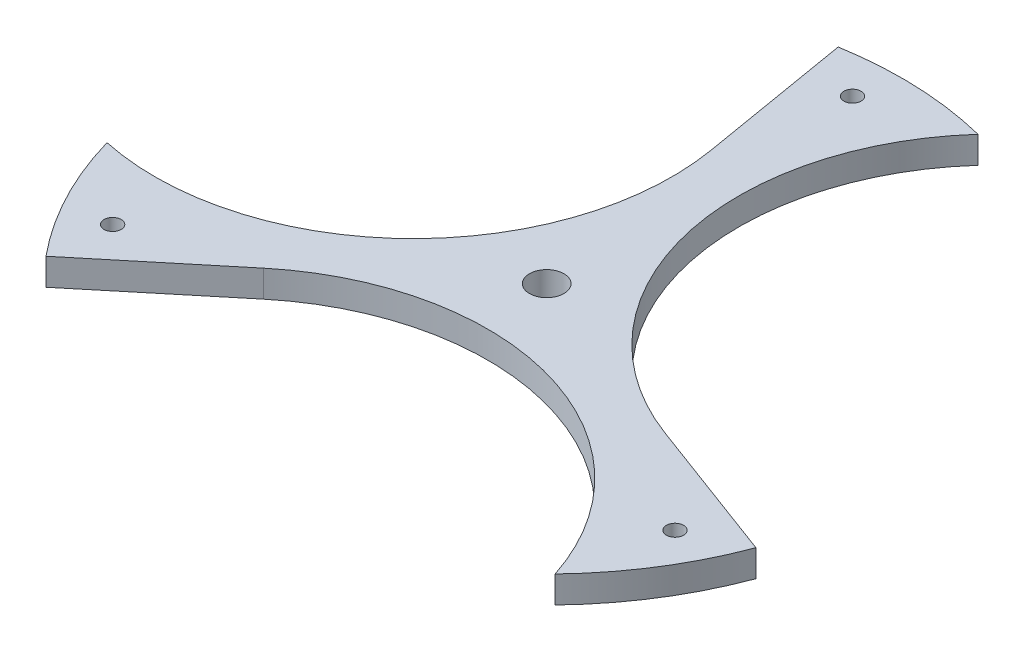
ISO-10303-21;
HEADER;
FILE_DESCRIPTION(('STEP AP214'),'2;1');
FILE_NAME('part.step','',(''),(''),'','','');
FILE_SCHEMA(('AUTOMOTIVE_DESIGN { 1 0 10303 214 1 1 1 1 }'));
ENDSEC;
DATA;
#1=APPLICATION_CONTEXT('core data for automotive mechanical design processes');
#2=APPLICATION_PROTOCOL_DEFINITION('international standard','automotive_design',2000,#1);
#3=PRODUCT_CONTEXT('',#1,'mechanical');
#4=PRODUCT('Part','Part','',(#3));
#5=PRODUCT_RELATED_PRODUCT_CATEGORY('part','',(#4));
#6=PRODUCT_DEFINITION_FORMATION('','',#4);
#7=PRODUCT_DEFINITION_CONTEXT('part definition',#1,'design');
#8=PRODUCT_DEFINITION('design','',#6,#7);
#9=PRODUCT_DEFINITION_SHAPE('','',#8);
#10=(LENGTH_UNIT() NAMED_UNIT(*) SI_UNIT(.MILLI.,.METRE.));
#11=(NAMED_UNIT(*) PLANE_ANGLE_UNIT() SI_UNIT($,.RADIAN.));
#12=(NAMED_UNIT(*) SI_UNIT($,.STERADIAN.) SOLID_ANGLE_UNIT());
#13=UNCERTAINTY_MEASURE_WITH_UNIT(LENGTH_MEASURE(1.E-05),#10,'distance_accuracy_value','');
#14=(GEOMETRIC_REPRESENTATION_CONTEXT(3) GLOBAL_UNCERTAINTY_ASSIGNED_CONTEXT((#13)) GLOBAL_UNIT_ASSIGNED_CONTEXT((#10,
#11,#12)) REPRESENTATION_CONTEXT('',''));
#15=CARTESIAN_POINT('',(0.,0.,0.));
#16=DIRECTION('',(0.,0.,1.));
#17=DIRECTION('',(1.,0.,0.));
#18=AXIS2_PLACEMENT_3D('',#15,#16,#17);
#19=CARTESIAN_POINT('',(1.81029657284749,2.4765,60.2978312322951));
#20=DIRECTION('',(0.,1.,0.));
#21=DIRECTION('',(0.,0.,1.));
#22=AXIS2_PLACEMENT_3D('',#19,#20,#21);
#23=PLANE('',#22);
#24=CARTESIAN_POINT('',(-49.4210911134615,2.4765,30.5465083084248));
#25=DIRECTION('',(0.,1.,0.));
#26=DIRECTION('',(0.,0.,1.));
#27=AXIS2_PLACEMENT_3D('',#24,#25,#26);
#28=CIRCLE('',#27,1.5875);
#29=CARTESIAN_POINT('',(-49.4210911134615,2.4765,32.1340083084248));
#30=VERTEX_POINT('',#29);
#31=EDGE_CURVE('E214',#30,#30,#28,.T.);
#32=ORIENTED_EDGE('',*,*,#31,.F.);
#33=EDGE_LOOP('',(#32));
#34=FACE_BOUND('',#33,.T.);
#35=CARTESIAN_POINT('',(0.,2.4765,0.));
#36=DIRECTION('',(0.,1.,0.));
#37=DIRECTION('',(0.,0.,1.));
#38=AXIS2_PLACEMENT_3D('',#35,#36,#37);
#39=CIRCLE('',#38,3.175);
#40=CARTESIAN_POINT('',(0.,2.4765,3.17500000000003));
#41=VERTEX_POINT('',#40);
#42=EDGE_CURVE('E150',#41,#41,#39,.T.);
#43=ORIENTED_EDGE('',*,*,#42,.F.);
#44=EDGE_LOOP('',(#43));
#45=FACE_BOUND('',#44,.T.);
#46=CARTESIAN_POINT('',(1.81029657284749,2.4765,60.2978312322951));
#47=DIRECTION('',(0.,-1.,0.));
#48=DIRECTION('',(0.,0.,1.));
#49=AXIS2_PLACEMENT_3D('',#46,#47,#48);
#50=CIRCLE('',#49,47.625);
#51=CARTESIAN_POINT('',(-28.5363220622247,2.4765,23.5932897909763));
#52=VERTEX_POINT('',#51);
#53=CARTESIAN_POINT('',(47.093148028681,2.4765,45.546424891579));
#54=VERTEX_POINT('',#53);
#55=EDGE_CURVE('E163',#52,#54,#50,.T.);
#56=ORIENTED_EDGE('',*,*,#55,.T.);
#57=CARTESIAN_POINT('',(0.,2.4765,0.));
#58=DIRECTION('',(0.,1.,0.));
#59=DIRECTION('',(0.,0.,1.));
#60=AXIS2_PLACEMENT_3D('',#57,#58,#59);
#61=CIRCLE('',#60,65.5151998520611);
#62=CARTESIAN_POINT('',(61.3995568393179,2.4765,22.8546676105973));
#63=VERTEX_POINT('',#62);
#64=EDGE_CURVE('E106',#54,#63,#61,.T.);
#65=ORIENTED_EDGE('',*,*,#64,.T.);
#66=DIRECTION('',(-0.937180333387722,0.,-0.348845270444188));
#67=VECTOR('',#66,1.);
#68=CARTESIAN_POINT('',(34.7005493489459,2.4765,12.9165349409727));
#69=LINE('',#68,#67);
#70=CARTESIAN_POINT('',(34.7005493489459,2.4765,12.9165349409727));
#71=VERTEX_POINT('',#70);
#72=EDGE_CURVE('E181',#63,#71,#69,.T.);
#73=ORIENTED_EDGE('',*,*,#72,.T.);
#74=CARTESIAN_POINT('',(51.3143053538503,2.4765,-31.7166784366176));
#75=DIRECTION('',(0.,-1.,0.));
#76=DIRECTION('',(0.,0.,1.));
#77=AXIS2_PLACEMENT_3D('',#74,#75,#76);
#78=CIRCLE('',#77,47.625);
#79=CARTESIAN_POINT('',(15.8977869933265,2.4765,-63.5570749828084));
#80=VERTEX_POINT('',#79);
#81=EDGE_CURVE('E198',#71,#80,#78,.T.);
#82=ORIENTED_EDGE('',*,*,#81,.T.);
#83=CARTESIAN_POINT('',(0.,2.4765,0.));
#84=DIRECTION('',(0.,1.,0.));
#85=DIRECTION('',(0.,0.,1.));
#86=AXIS2_PLACEMENT_3D('',#83,#84,#85);
#87=CIRCLE('',#86,65.5151998520611);
#88=CARTESIAN_POINT('',(-10.9070556738326,2.4765,-64.6009098092544));
#89=VERTEX_POINT('',#88);
#90=EDGE_CURVE('E197',#80,#89,#87,.T.);
#91=ORIENTED_EDGE('',*,*,#90,.T.);
#92=DIRECTION('',(0.166481300499146,0.,0.98604461186303));
#93=VECTOR('',#92,1.);
#94=CARTESIAN_POINT('',(-6.16422728672149,2.4765,-36.509824731949));
#95=LINE('',#94,#93);
#96=CARTESIAN_POINT('',(-6.16422728672147,2.4765,-36.509824731949));
#97=VERTEX_POINT('',#96);
#98=EDGE_CURVE('E128',#89,#97,#95,.T.);
#99=ORIENTED_EDGE('',*,*,#98,.T.);
#100=CARTESIAN_POINT('',(-53.1246019266983,2.4765,-28.5811527956771));
#101=DIRECTION('',(0.,-1.,0.));
#102=DIRECTION('',(0.,0.,1.));
#103=AXIS2_PLACEMENT_3D('',#100,#101,#102);
#104=CIRCLE('',#103,47.625);
#105=CARTESIAN_POINT('',(-62.9909350220076,2.4765,18.01065009123));
#106=VERTEX_POINT('',#105);
#107=EDGE_CURVE('E122',#97,#106,#104,.T.);
#108=ORIENTED_EDGE('',*,*,#107,.T.);
#109=CARTESIAN_POINT('',(0.,2.4765,0.));
#110=DIRECTION('',(0.,1.,0.));
#111=DIRECTION('',(0.,0.,1.));
#112=AXIS2_PLACEMENT_3D('',#109,#110,#111);
#113=CIRCLE('',#112,65.5151998520611);
#114=CARTESIAN_POINT('',(-50.4925011654858,2.4765,41.746242198657));
#115=VERTEX_POINT('',#114);
#116=EDGE_CURVE('E126',#106,#115,#113,.T.);
#117=ORIENTED_EDGE('',*,*,#116,.T.);
#118=DIRECTION('',(0.770699032888583,0.,-0.637199341418839));
#119=VECTOR('',#118,1.);
#120=CARTESIAN_POINT('',(-28.5363220622247,2.4765,23.5932897909763));
#121=LINE('',#120,#119);
#122=EDGE_CURVE('E60',#115,#52,#121,.T.);
#123=ORIENTED_EDGE('',*,*,#122,.T.);
#124=EDGE_LOOP('',(#56,#65,#73,#82,#91,#99,#108,#117,#123));
#125=FACE_BOUND('',#124,.T.);
#126=CARTESIAN_POINT('',(-1.74350663527732,2.4765,-58.0731745412153));
#127=DIRECTION('',(0.,1.,0.));
#128=DIRECTION('',(0.,0.,1.));
#129=AXIS2_PLACEMENT_3D('',#126,#127,#128);
#130=CIRCLE('',#129,1.5875);
#131=CARTESIAN_POINT('',(-1.74350663527732,2.4765,-56.4856745412153));
#132=VERTEX_POINT('',#131);
#133=EDGE_CURVE('E208',#132,#132,#130,.T.);
#134=ORIENTED_EDGE('',*,*,#133,.F.);
#135=EDGE_LOOP('',(#134));
#136=FACE_BOUND('',#135,.T.);
#137=CARTESIAN_POINT('',(51.1645977487387,2.4765,27.5266662327911));
#138=DIRECTION('',(0.,1.,0.));
#139=DIRECTION('',(0.,0.,1.));
#140=AXIS2_PLACEMENT_3D('',#137,#138,#139);
#141=CIRCLE('',#140,1.5875);
#142=CARTESIAN_POINT('',(51.1645977487387,2.4765,29.1141662327911));
#143=VERTEX_POINT('',#142);
#144=EDGE_CURVE('E220',#143,#143,#141,.T.);
#145=ORIENTED_EDGE('',*,*,#144,.F.);
#146=EDGE_LOOP('',(#145));
#147=FACE_BOUND('',#146,.T.);
#148=ADVANCED_FACE('F43',(#34,#45,#125,#136,#147),#23,.T.);
#149=CARTESIAN_POINT('',(1.81029657284749,-2.4765,60.2978312322951));
#150=DIRECTION('',(0.,1.,0.));
#151=DIRECTION('',(0.,0.,1.));
#152=AXIS2_PLACEMENT_3D('',#149,#150,#151);
#153=PLANE('',#152);
#154=CARTESIAN_POINT('',(1.81029657284749,-2.4765,60.2978312322951));
#155=DIRECTION('',(0.,-1.,0.));
#156=DIRECTION('',(0.,0.,1.));
#157=AXIS2_PLACEMENT_3D('',#154,#155,#156);
#158=CIRCLE('',#157,47.625);
#159=CARTESIAN_POINT('',(-28.5363220622247,-2.4765,23.5932897909763));
#160=VERTEX_POINT('',#159);
#161=CARTESIAN_POINT('',(47.093148028681,-2.4765,45.546424891579));
#162=VERTEX_POINT('',#161);
#163=EDGE_CURVE('E146',#160,#162,#158,.T.);
#164=ORIENTED_EDGE('',*,*,#163,.F.);
#165=DIRECTION('',(0.770699032888583,0.,-0.637199341418839));
#166=VECTOR('',#165,1.);
#167=CARTESIAN_POINT('',(-28.5363220622247,-2.4765,23.5932897909763));
#168=LINE('',#167,#166);
#169=CARTESIAN_POINT('',(-50.4925011654858,-2.4765,41.746242198657));
#170=VERTEX_POINT('',#169);
#171=EDGE_CURVE('E98',#170,#160,#168,.T.);
#172=ORIENTED_EDGE('',*,*,#171,.F.);
#173=CARTESIAN_POINT('',(0.,-2.4765,0.));
#174=DIRECTION('',(0.,1.,0.));
#175=DIRECTION('',(0.,0.,1.));
#176=AXIS2_PLACEMENT_3D('',#173,#174,#175);
#177=CIRCLE('',#176,65.5151998520611);
#178=CARTESIAN_POINT('',(-62.9909350220076,-2.4765,18.01065009123));
#179=VERTEX_POINT('',#178);
#180=EDGE_CURVE('E92',#179,#170,#177,.T.);
#181=ORIENTED_EDGE('',*,*,#180,.F.);
#182=CARTESIAN_POINT('',(-53.1246019266983,-2.4765,-28.5811527956771));
#183=DIRECTION('',(0.,-1.,0.));
#184=DIRECTION('',(0.,0.,1.));
#185=AXIS2_PLACEMENT_3D('',#182,#183,#184);
#186=CIRCLE('',#185,47.625);
#187=CARTESIAN_POINT('',(-6.16422728672147,-2.4765,-36.509824731949));
#188=VERTEX_POINT('',#187);
#189=EDGE_CURVE('E136',#188,#179,#186,.T.);
#190=ORIENTED_EDGE('',*,*,#189,.F.);
#191=DIRECTION('',(0.166481300499146,0.,0.98604461186303));
#192=VECTOR('',#191,1.);
#193=CARTESIAN_POINT('',(-6.16422728672149,-2.4765,-36.509824731949));
#194=LINE('',#193,#192);
#195=CARTESIAN_POINT('',(-10.9070556738326,-2.4765,-64.6009098092544));
#196=VERTEX_POINT('',#195);
#197=EDGE_CURVE('E158',#196,#188,#194,.T.);
#198=ORIENTED_EDGE('',*,*,#197,.F.);
#199=CARTESIAN_POINT('',(0.,-2.4765,0.));
#200=DIRECTION('',(0.,1.,0.));
#201=DIRECTION('',(0.,0.,1.));
#202=AXIS2_PLACEMENT_3D('',#199,#200,#201);
#203=CIRCLE('',#202,65.5151998520611);
#204=CARTESIAN_POINT('',(15.8977869933265,-2.4765,-63.5570749828084));
#205=VERTEX_POINT('',#204);
#206=EDGE_CURVE('E156',#205,#196,#203,.T.);
#207=ORIENTED_EDGE('',*,*,#206,.F.);
#208=CARTESIAN_POINT('',(51.3143053538503,-2.4765,-31.7166784366176));
#209=DIRECTION('',(0.,-1.,0.));
#210=DIRECTION('',(0.,0.,1.));
#211=AXIS2_PLACEMENT_3D('',#208,#209,#210);
#212=CIRCLE('',#211,47.625);
#213=CARTESIAN_POINT('',(34.7005493489459,-2.4765,12.9165349409727));
#214=VERTEX_POINT('',#213);
#215=EDGE_CURVE('E154',#214,#205,#212,.T.);
#216=ORIENTED_EDGE('',*,*,#215,.F.);
#217=DIRECTION('',(-0.937180333387722,0.,-0.348845270444188));
#218=VECTOR('',#217,1.);
#219=CARTESIAN_POINT('',(34.7005493489459,-2.4765,12.9165349409727));
#220=LINE('',#219,#218);
#221=CARTESIAN_POINT('',(61.3995568393179,-2.4765,22.8546676105973));
#222=VERTEX_POINT('',#221);
#223=EDGE_CURVE('E152',#222,#214,#220,.T.);
#224=ORIENTED_EDGE('',*,*,#223,.F.);
#225=CARTESIAN_POINT('',(0.,-2.4765,0.));
#226=DIRECTION('',(0.,1.,0.));
#227=DIRECTION('',(0.,0.,1.));
#228=AXIS2_PLACEMENT_3D('',#225,#226,#227);
#229=CIRCLE('',#228,65.5151998520611);
#230=EDGE_CURVE('E149',#162,#222,#229,.T.);
#231=ORIENTED_EDGE('',*,*,#230,.F.);
#232=EDGE_LOOP('',(#164,#172,#181,#190,#198,#207,#216,#224,#231));
#233=FACE_BOUND('',#232,.T.);
#234=CARTESIAN_POINT('',(0.,-2.4765,0.));
#235=DIRECTION('',(0.,1.,0.));
#236=DIRECTION('',(0.,0.,1.));
#237=AXIS2_PLACEMENT_3D('',#234,#235,#236);
#238=CIRCLE('',#237,3.175);
#239=CARTESIAN_POINT('',(0.,-2.4765,3.17500000000003));
#240=VERTEX_POINT('',#239);
#241=EDGE_CURVE('E205',#240,#240,#238,.T.);
#242=ORIENTED_EDGE('',*,*,#241,.T.);
#243=EDGE_LOOP('',(#242));
#244=FACE_BOUND('',#243,.T.);
#245=CARTESIAN_POINT('',(-1.74350663527732,-2.4765,-58.0731745412153));
#246=DIRECTION('',(0.,1.,0.));
#247=DIRECTION('',(0.,0.,1.));
#248=AXIS2_PLACEMENT_3D('',#245,#246,#247);
#249=CIRCLE('',#248,1.5875);
#250=CARTESIAN_POINT('',(-1.74350663527732,-2.4765,-56.4856745412153));
#251=VERTEX_POINT('',#250);
#252=EDGE_CURVE('E211',#251,#251,#249,.T.);
#253=ORIENTED_EDGE('',*,*,#252,.T.);
#254=EDGE_LOOP('',(#253));
#255=FACE_BOUND('',#254,.T.);
#256=CARTESIAN_POINT('',(-49.4210911134615,-2.4765,30.5465083084248));
#257=DIRECTION('',(0.,1.,0.));
#258=DIRECTION('',(0.,0.,1.));
#259=AXIS2_PLACEMENT_3D('',#256,#257,#258);
#260=CIRCLE('',#259,1.5875);
#261=CARTESIAN_POINT('',(-49.4210911134615,-2.4765,32.1340083084248));
#262=VERTEX_POINT('',#261);
#263=EDGE_CURVE('E217',#262,#262,#260,.T.);
#264=ORIENTED_EDGE('',*,*,#263,.T.);
#265=EDGE_LOOP('',(#264));
#266=FACE_BOUND('',#265,.T.);
#267=CARTESIAN_POINT('',(51.1645977487387,-2.4765,27.5266662327911));
#268=DIRECTION('',(0.,1.,0.));
#269=DIRECTION('',(0.,0.,1.));
#270=AXIS2_PLACEMENT_3D('',#267,#268,#269);
#271=CIRCLE('',#270,1.5875);
#272=CARTESIAN_POINT('',(51.1645977487387,-2.4765,29.1141662327911));
#273=VERTEX_POINT('',#272);
#274=EDGE_CURVE('E223',#273,#273,#271,.T.);
#275=ORIENTED_EDGE('',*,*,#274,.T.);
#276=EDGE_LOOP('',(#275));
#277=FACE_BOUND('',#276,.T.);
#278=ADVANCED_FACE('F185',(#233,#244,#255,#266,#277),#153,.F.);
#279=CARTESIAN_POINT('',(1.81029657284749,2.4765,60.2978312322951));
#280=DIRECTION('',(0.,-1.,0.));
#281=DIRECTION('',(0.,0.,-1.));
#282=AXIS2_PLACEMENT_3D('',#279,#280,#281);
#283=CYLINDRICAL_SURFACE('',#282,47.625);
#284=ORIENTED_EDGE('',*,*,#163,.T.);
#285=DIRECTION('',(0.,-1.,0.));
#286=VECTOR('',#285,1.);
#287=CARTESIAN_POINT('',(47.093148028681,2.4765,45.546424891579));
#288=LINE('',#287,#286);
#289=EDGE_CURVE('E13',#54,#162,#288,.T.);
#290=ORIENTED_EDGE('',*,*,#289,.F.);
#291=ORIENTED_EDGE('',*,*,#55,.F.);
#292=DIRECTION('',(0.,-1.,0.));
#293=VECTOR('',#292,1.);
#294=CARTESIAN_POINT('',(-28.5363220622247,2.4765,23.5932897909763));
#295=LINE('',#294,#293);
#296=EDGE_CURVE('E142',#52,#160,#295,.T.);
#297=ORIENTED_EDGE('',*,*,#296,.T.);
#298=EDGE_LOOP('',(#284,#290,#291,#297));
#299=FACE_BOUND('',#298,.T.);
#300=ADVANCED_FACE('F45',(#299),#283,.F.);
#301=CARTESIAN_POINT('',(0.,2.4765,0.));
#302=DIRECTION('',(0.,-1.,0.));
#303=DIRECTION('',(0.,0.,-1.));
#304=AXIS2_PLACEMENT_3D('',#301,#302,#303);
#305=CYLINDRICAL_SURFACE('',#304,65.5151998520611);
#306=ORIENTED_EDGE('',*,*,#230,.T.);
#307=DIRECTION('',(0.,-1.,0.));
#308=VECTOR('',#307,1.);
#309=CARTESIAN_POINT('',(61.3995568393179,2.4765,22.8546676105973));
#310=LINE('',#309,#308);
#311=EDGE_CURVE('E52',#63,#222,#310,.T.);
#312=ORIENTED_EDGE('',*,*,#311,.F.);
#313=ORIENTED_EDGE('',*,*,#64,.F.);
#314=ORIENTED_EDGE('',*,*,#289,.T.);
#315=EDGE_LOOP('',(#306,#312,#313,#314));
#316=FACE_BOUND('',#315,.T.);
#317=ADVANCED_FACE('F261',(#316),#305,.T.);
#318=CARTESIAN_POINT('',(34.7005493489459,2.4765,12.9165349409727));
#319=DIRECTION('',(-0.348845270444188,0.,0.937180333387722));
#320=DIRECTION('',(0.937180333387722,0.,0.348845270444188));
#321=AXIS2_PLACEMENT_3D('',#318,#319,#320);
#322=PLANE('',#321);
#323=ORIENTED_EDGE('',*,*,#223,.T.);
#324=DIRECTION('',(0.,-1.,0.));
#325=VECTOR('',#324,1.);
#326=CARTESIAN_POINT('',(34.7005493489459,2.4765,12.9165349409727));
#327=LINE('',#326,#325);
#328=EDGE_CURVE('E173',#71,#214,#327,.T.);
#329=ORIENTED_EDGE('',*,*,#328,.F.);
#330=ORIENTED_EDGE('',*,*,#72,.F.);
#331=ORIENTED_EDGE('',*,*,#311,.T.);
#332=EDGE_LOOP('',(#323,#329,#330,#331));
#333=FACE_BOUND('',#332,.T.);
#334=ADVANCED_FACE('F179',(#333),#322,.F.);
#335=CARTESIAN_POINT('',(51.3143053538503,2.4765,-31.7166784366176));
#336=DIRECTION('',(0.,-1.,0.));
#337=DIRECTION('',(0.,0.,-1.));
#338=AXIS2_PLACEMENT_3D('',#335,#336,#337);
#339=CYLINDRICAL_SURFACE('',#338,47.625);
#340=ORIENTED_EDGE('',*,*,#215,.T.);
#341=DIRECTION('',(0.,-1.,0.));
#342=VECTOR('',#341,1.);
#343=CARTESIAN_POINT('',(15.8977869933265,2.4765,-63.5570749828084));
#344=LINE('',#343,#342);
#345=EDGE_CURVE('E170',#80,#205,#344,.T.);
#346=ORIENTED_EDGE('',*,*,#345,.F.);
#347=ORIENTED_EDGE('',*,*,#81,.F.);
#348=ORIENTED_EDGE('',*,*,#328,.T.);
#349=EDGE_LOOP('',(#340,#346,#347,#348));
#350=FACE_BOUND('',#349,.T.);
#351=ADVANCED_FACE('F191',(#350),#339,.F.);
#352=CARTESIAN_POINT('',(0.,2.4765,0.));
#353=DIRECTION('',(0.,-1.,0.));
#354=DIRECTION('',(0.,0.,-1.));
#355=AXIS2_PLACEMENT_3D('',#352,#353,#354);
#356=CYLINDRICAL_SURFACE('',#355,65.5151998520611);
#357=ORIENTED_EDGE('',*,*,#206,.T.);
#358=DIRECTION('',(0.,-1.,0.));
#359=VECTOR('',#358,1.);
#360=CARTESIAN_POINT('',(-10.9070556738326,2.4765,-64.6009098092544));
#361=LINE('',#360,#359);
#362=EDGE_CURVE('E167',#89,#196,#361,.T.);
#363=ORIENTED_EDGE('',*,*,#362,.F.);
#364=ORIENTED_EDGE('',*,*,#90,.F.);
#365=ORIENTED_EDGE('',*,*,#345,.T.);
#366=EDGE_LOOP('',(#357,#363,#364,#365));
#367=FACE_BOUND('',#366,.T.);
#368=ADVANCED_FACE('F195',(#367),#356,.T.);
#369=CARTESIAN_POINT('',(-6.16422728672149,2.4765,-36.509824731949));
#370=DIRECTION('',(0.98604461186303,0.,-0.166481300499146));
#371=DIRECTION('',(-0.166481300499146,0.,-0.98604461186303));
#372=AXIS2_PLACEMENT_3D('',#369,#370,#371);
#373=PLANE('',#372);
#374=ORIENTED_EDGE('',*,*,#197,.T.);
#375=DIRECTION('',(0.,-1.,0.));
#376=VECTOR('',#375,1.);
#377=CARTESIAN_POINT('',(-6.16422728672147,2.4765,-36.509824731949));
#378=LINE('',#377,#376);
#379=EDGE_CURVE('E137',#97,#188,#378,.T.);
#380=ORIENTED_EDGE('',*,*,#379,.F.);
#381=ORIENTED_EDGE('',*,*,#98,.F.);
#382=ORIENTED_EDGE('',*,*,#362,.T.);
#383=EDGE_LOOP('',(#374,#380,#381,#382));
#384=FACE_BOUND('',#383,.T.);
#385=ADVANCED_FACE('F252',(#384),#373,.F.);
#386=CARTESIAN_POINT('',(-53.1246019266983,2.4765,-28.5811527956771));
#387=DIRECTION('',(0.,-1.,0.));
#388=DIRECTION('',(0.,0.,-1.));
#389=AXIS2_PLACEMENT_3D('',#386,#387,#388);
#390=CYLINDRICAL_SURFACE('',#389,47.625);
#391=ORIENTED_EDGE('',*,*,#189,.T.);
#392=DIRECTION('',(0.,-1.,0.));
#393=VECTOR('',#392,1.);
#394=CARTESIAN_POINT('',(-62.9909350220076,2.4765,18.01065009123));
#395=LINE('',#394,#393);
#396=EDGE_CURVE('E133',#106,#179,#395,.T.);
#397=ORIENTED_EDGE('',*,*,#396,.F.);
#398=ORIENTED_EDGE('',*,*,#107,.F.);
#399=ORIENTED_EDGE('',*,*,#379,.T.);
#400=EDGE_LOOP('',(#391,#397,#398,#399));
#401=FACE_BOUND('',#400,.T.);
#402=ADVANCED_FACE('F134',(#401),#390,.F.);
#403=CARTESIAN_POINT('',(0.,2.4765,0.));
#404=DIRECTION('',(0.,-1.,0.));
#405=DIRECTION('',(0.,0.,-1.));
#406=AXIS2_PLACEMENT_3D('',#403,#404,#405);
#407=CYLINDRICAL_SURFACE('',#406,65.5151998520611);
#408=ORIENTED_EDGE('',*,*,#180,.T.);
#409=DIRECTION('',(0.,-1.,0.));
#410=VECTOR('',#409,1.);
#411=CARTESIAN_POINT('',(-50.4925011654858,2.4765,41.746242198657));
#412=LINE('',#411,#410);
#413=EDGE_CURVE('E138',#115,#170,#412,.T.);
#414=ORIENTED_EDGE('',*,*,#413,.F.);
#415=ORIENTED_EDGE('',*,*,#116,.F.);
#416=ORIENTED_EDGE('',*,*,#396,.T.);
#417=EDGE_LOOP('',(#408,#414,#415,#416));
#418=FACE_BOUND('',#417,.T.);
#419=ADVANCED_FACE('F140',(#418),#407,.T.);
#420=CARTESIAN_POINT('',(-28.5363220622247,2.4765,23.5932897909763));
#421=DIRECTION('',(-0.637199341418839,0.,-0.770699032888583));
#422=DIRECTION('',(-0.770699032888583,0.,0.637199341418839));
#423=AXIS2_PLACEMENT_3D('',#420,#421,#422);
#424=PLANE('',#423);
#425=ORIENTED_EDGE('',*,*,#171,.T.);
#426=ORIENTED_EDGE('',*,*,#296,.F.);
#427=ORIENTED_EDGE('',*,*,#122,.F.);
#428=ORIENTED_EDGE('',*,*,#413,.T.);
#429=EDGE_LOOP('',(#425,#426,#427,#428));
#430=FACE_BOUND('',#429,.T.);
#431=ADVANCED_FACE('F245',(#430),#424,.F.);
#432=CARTESIAN_POINT('',(0.,2.4765,0.));
#433=DIRECTION('',(0.,-1.,0.));
#434=DIRECTION('',(0.,0.,-1.));
#435=AXIS2_PLACEMENT_3D('',#432,#433,#434);
#436=CYLINDRICAL_SURFACE('',#435,3.175);
#437=ORIENTED_EDGE('',*,*,#42,.T.);
#438=EDGE_LOOP('',(#437));
#439=FACE_BOUND('',#438,.T.);
#440=ORIENTED_EDGE('',*,*,#241,.F.);
#441=EDGE_LOOP('',(#440));
#442=FACE_BOUND('',#441,.T.);
#443=ADVANCED_FACE('F242',(#439,#442),#436,.F.);
#444=CARTESIAN_POINT('',(-1.74350663527732,2.4765,-58.0731745412153));
#445=DIRECTION('',(0.,-1.,0.));
#446=DIRECTION('',(0.,0.,-1.));
#447=AXIS2_PLACEMENT_3D('',#444,#445,#446);
#448=CYLINDRICAL_SURFACE('',#447,1.5875);
#449=ORIENTED_EDGE('',*,*,#133,.T.);
#450=EDGE_LOOP('',(#449));
#451=FACE_BOUND('',#450,.T.);
#452=ORIENTED_EDGE('',*,*,#252,.F.);
#453=EDGE_LOOP('',(#452));
#454=FACE_BOUND('',#453,.T.);
#455=ADVANCED_FACE('F330',(#451,#454),#448,.F.);
#456=CARTESIAN_POINT('',(-49.4210911134615,2.4765,30.5465083084248));
#457=DIRECTION('',(0.,-1.,0.));
#458=DIRECTION('',(0.,0.,-1.));
#459=AXIS2_PLACEMENT_3D('',#456,#457,#458);
#460=CYLINDRICAL_SURFACE('',#459,1.5875);
#461=ORIENTED_EDGE('',*,*,#31,.T.);
#462=EDGE_LOOP('',(#461));
#463=FACE_BOUND('',#462,.T.);
#464=ORIENTED_EDGE('',*,*,#263,.F.);
#465=EDGE_LOOP('',(#464));
#466=FACE_BOUND('',#465,.T.);
#467=ADVANCED_FACE('F338',(#463,#466),#460,.F.);
#468=CARTESIAN_POINT('',(51.1645977487387,2.4765,27.5266662327911));
#469=DIRECTION('',(0.,-1.,0.));
#470=DIRECTION('',(0.,0.,-1.));
#471=AXIS2_PLACEMENT_3D('',#468,#469,#470);
#472=CYLINDRICAL_SURFACE('',#471,1.5875);
#473=ORIENTED_EDGE('',*,*,#144,.T.);
#474=EDGE_LOOP('',(#473));
#475=FACE_BOUND('',#474,.T.);
#476=ORIENTED_EDGE('',*,*,#274,.F.);
#477=EDGE_LOOP('',(#476));
#478=FACE_BOUND('',#477,.T.);
#479=ADVANCED_FACE('F229',(#475,#478),#472,.F.);
#480=CLOSED_SHELL('',(#148,#278,#300,#317,#334,#351,#368,#385,#402,#419,#431,#443,#455,#467,#479));
#481=MANIFOLD_SOLID_BREP('B2',#480);
#482=ADVANCED_BREP_SHAPE_REPRESENTATION('',(#18,#481),#14);
#483=SHAPE_DEFINITION_REPRESENTATION(#9,#482);
ENDSEC;
END-ISO-10303-21;
